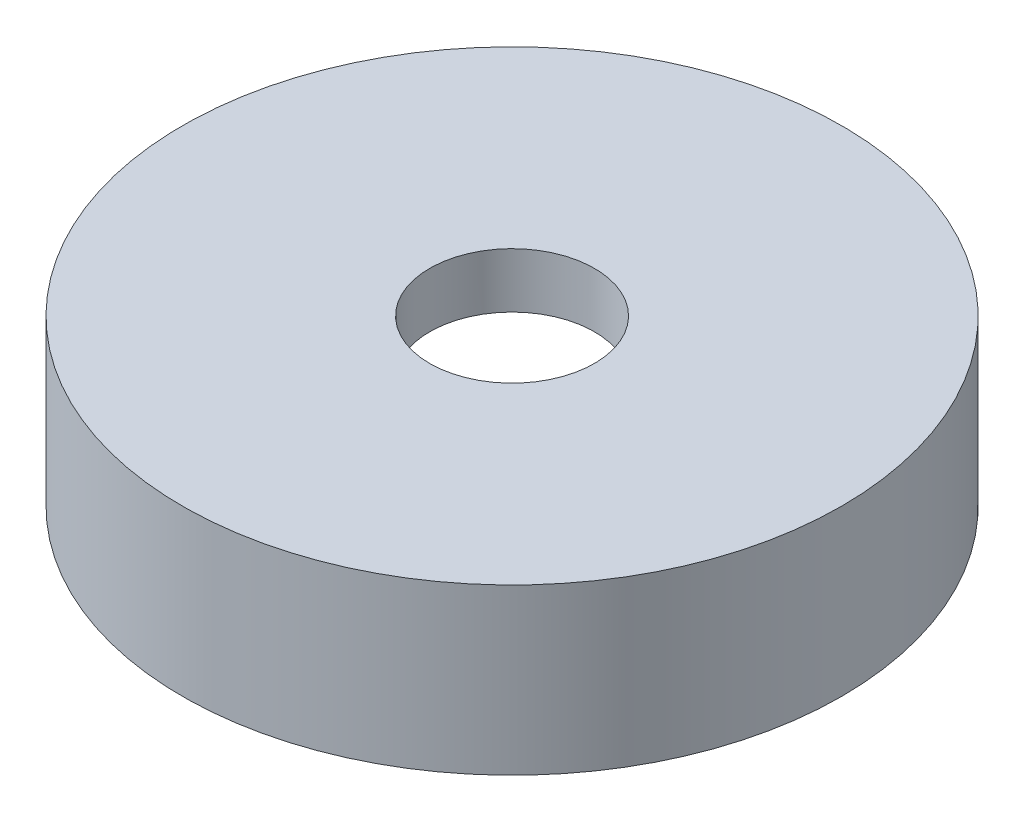
ISO-10303-21;
HEADER;
FILE_DESCRIPTION(('STEP AP214'),'2;1');
FILE_NAME('part.step','',(''),(''),'','','');
FILE_SCHEMA(('AUTOMOTIVE_DESIGN { 1 0 10303 214 1 1 1 1 }'));
ENDSEC;
DATA;
#1=APPLICATION_CONTEXT('core data for automotive mechanical design processes');
#2=APPLICATION_PROTOCOL_DEFINITION('international standard','automotive_design',2000,#1);
#3=PRODUCT_CONTEXT('',#1,'mechanical');
#4=PRODUCT('Part','Part','',(#3));
#5=PRODUCT_RELATED_PRODUCT_CATEGORY('part','',(#4));
#6=PRODUCT_DEFINITION_FORMATION('','',#4);
#7=PRODUCT_DEFINITION_CONTEXT('part definition',#1,'design');
#8=PRODUCT_DEFINITION('design','',#6,#7);
#9=PRODUCT_DEFINITION_SHAPE('','',#8);
#10=(LENGTH_UNIT() NAMED_UNIT(*) SI_UNIT(.MILLI.,.METRE.));
#11=(NAMED_UNIT(*) PLANE_ANGLE_UNIT() SI_UNIT($,.RADIAN.));
#12=(NAMED_UNIT(*) SI_UNIT($,.STERADIAN.) SOLID_ANGLE_UNIT());
#13=UNCERTAINTY_MEASURE_WITH_UNIT(LENGTH_MEASURE(1.E-05),#10,'distance_accuracy_value','');
#14=(GEOMETRIC_REPRESENTATION_CONTEXT(3) GLOBAL_UNCERTAINTY_ASSIGNED_CONTEXT((#13)) GLOBAL_UNIT_ASSIGNED_CONTEXT((#10,
#11,#12)) REPRESENTATION_CONTEXT('',''));
#15=CARTESIAN_POINT('',(0.,0.,0.));
#16=DIRECTION('',(0.,0.,1.));
#17=DIRECTION('',(1.,0.,0.));
#18=AXIS2_PLACEMENT_3D('',#15,#16,#17);
#19=CARTESIAN_POINT('',(0.,2.,0.));
#20=DIRECTION('',(0.,-1.,0.));
#21=DIRECTION('',(1.,0.,0.));
#22=AXIS2_PLACEMENT_3D('',#19,#20,#21);
#23=PLANE('',#22);
#24=CARTESIAN_POINT('',(0.,2.,0.));
#25=DIRECTION('',(0.,-1.,0.));
#26=DIRECTION('',(1.,0.,0.));
#27=AXIS2_PLACEMENT_3D('',#24,#25,#26);
#28=CIRCLE('',#27,1.5);
#29=CARTESIAN_POINT('',(1.5,2.,0.));
#30=VERTEX_POINT('',#29);
#31=EDGE_CURVE('E62',#30,#30,#28,.T.);
#32=ORIENTED_EDGE('',*,*,#31,.F.);
#33=EDGE_LOOP('',(#32));
#34=FACE_BOUND('',#33,.T.);
#35=CARTESIAN_POINT('',(0.,2.,0.));
#36=DIRECTION('',(0.,-1.,0.));
#37=DIRECTION('',(1.,0.,0.));
#38=AXIS2_PLACEMENT_3D('',#35,#36,#37);
#39=CIRCLE('',#38,5.);
#40=CARTESIAN_POINT('',(5.,2.,0.));
#41=VERTEX_POINT('',#40);
#42=EDGE_CURVE('E10',#41,#41,#39,.T.);
#43=ORIENTED_EDGE('',*,*,#42,.T.);
#44=EDGE_LOOP('',(#43));
#45=FACE_BOUND('',#44,.T.);
#46=ADVANCED_FACE('F39',(#34,#45),#23,.T.);
#47=CARTESIAN_POINT('',(0.,0.,0.));
#48=DIRECTION('',(0.,-1.,0.));
#49=DIRECTION('',(1.,0.,0.));
#50=AXIS2_PLACEMENT_3D('',#47,#48,#49);
#51=CYLINDRICAL_SURFACE('',#50,5.);
#52=CARTESIAN_POINT('',(0.,0.,0.));
#53=DIRECTION('',(0.,-1.,0.));
#54=DIRECTION('',(1.,0.,0.));
#55=AXIS2_PLACEMENT_3D('',#52,#53,#54);
#56=CIRCLE('',#55,5.);
#57=CARTESIAN_POINT('',(5.,0.,0.));
#58=VERTEX_POINT('',#57);
#59=EDGE_CURVE('E46',#58,#58,#56,.T.);
#60=ORIENTED_EDGE('',*,*,#59,.T.);
#61=EDGE_LOOP('',(#60));
#62=FACE_BOUND('',#61,.T.);
#63=ORIENTED_EDGE('',*,*,#42,.F.);
#64=EDGE_LOOP('',(#63));
#65=FACE_BOUND('',#64,.T.);
#66=ADVANCED_FACE('F88',(#62,#65),#51,.F.);
#67=CARTESIAN_POINT('',(5.,0.,0.));
#68=DIRECTION('',(0.,-1.,0.));
#69=DIRECTION('',(1.,0.,0.));
#70=AXIS2_PLACEMENT_3D('',#67,#68,#69);
#71=PLANE('',#70);
#72=CARTESIAN_POINT('',(0.,0.,0.));
#73=DIRECTION('',(0.,-1.,0.));
#74=DIRECTION('',(1.,0.,0.));
#75=AXIS2_PLACEMENT_3D('',#72,#73,#74);
#76=CIRCLE('',#75,6.);
#77=CARTESIAN_POINT('',(6.,0.,0.));
#78=VERTEX_POINT('',#77);
#79=EDGE_CURVE('E51',#78,#78,#76,.T.);
#80=ORIENTED_EDGE('',*,*,#79,.T.);
#81=EDGE_LOOP('',(#80));
#82=FACE_BOUND('',#81,.T.);
#83=ORIENTED_EDGE('',*,*,#59,.F.);
#84=EDGE_LOOP('',(#83));
#85=FACE_BOUND('',#84,.T.);
#86=ADVANCED_FACE('F82',(#82,#85),#71,.T.);
#87=CARTESIAN_POINT('',(0.,0.,0.));
#88=DIRECTION('',(0.,-1.,0.));
#89=DIRECTION('',(1.,0.,0.));
#90=AXIS2_PLACEMENT_3D('',#87,#88,#89);
#91=CYLINDRICAL_SURFACE('',#90,6.);
#92=CARTESIAN_POINT('',(0.,3.,0.));
#93=DIRECTION('',(0.,-1.,0.));
#94=DIRECTION('',(1.,0.,0.));
#95=AXIS2_PLACEMENT_3D('',#92,#93,#94);
#96=CIRCLE('',#95,6.);
#97=CARTESIAN_POINT('',(6.,3.,0.));
#98=VERTEX_POINT('',#97);
#99=EDGE_CURVE('E56',#98,#98,#96,.T.);
#100=ORIENTED_EDGE('',*,*,#99,.T.);
#101=EDGE_LOOP('',(#100));
#102=FACE_BOUND('',#101,.T.);
#103=ORIENTED_EDGE('',*,*,#79,.F.);
#104=EDGE_LOOP('',(#103));
#105=FACE_BOUND('',#104,.T.);
#106=ADVANCED_FACE('F76',(#102,#105),#91,.T.);
#107=CARTESIAN_POINT('',(0.,3.,0.));
#108=DIRECTION('',(0.,1.,0.));
#109=DIRECTION('',(-1.,0.,0.));
#110=AXIS2_PLACEMENT_3D('',#107,#108,#109);
#111=PLANE('',#110);
#112=CARTESIAN_POINT('',(0.,3.,0.));
#113=DIRECTION('',(0.,1.,0.));
#114=DIRECTION('',(0.,0.,1.));
#115=AXIS2_PLACEMENT_3D('',#112,#113,#114);
#116=CIRCLE('',#115,1.5);
#117=CARTESIAN_POINT('',(0.,3.,1.5));
#118=VERTEX_POINT('',#117);
#119=EDGE_CURVE('E66',#118,#118,#116,.T.);
#120=ORIENTED_EDGE('',*,*,#119,.F.);
#121=EDGE_LOOP('',(#120));
#122=FACE_BOUND('',#121,.T.);
#123=ORIENTED_EDGE('',*,*,#99,.F.);
#124=EDGE_LOOP('',(#123));
#125=FACE_BOUND('',#124,.T.);
#126=ADVANCED_FACE('F73',(#122,#125),#111,.T.);
#127=CARTESIAN_POINT('',(0.,3.,0.));
#128=DIRECTION('',(0.,1.,0.));
#129=DIRECTION('',(0.,0.,1.));
#130=AXIS2_PLACEMENT_3D('',#127,#128,#129);
#131=CYLINDRICAL_SURFACE('',#130,1.5);
#132=ORIENTED_EDGE('',*,*,#31,.T.);
#133=EDGE_LOOP('',(#132));
#134=FACE_BOUND('',#133,.T.);
#135=ORIENTED_EDGE('',*,*,#119,.T.);
#136=EDGE_LOOP('',(#135));
#137=FACE_BOUND('',#136,.T.);
#138=ADVANCED_FACE('F71',(#134,#137),#131,.F.);
#139=CLOSED_SHELL('',(#46,#66,#86,#106,#126,#138));
#140=MANIFOLD_SOLID_BREP('B2',#139);
#141=ADVANCED_BREP_SHAPE_REPRESENTATION('',(#18,#140),#14);
#142=SHAPE_DEFINITION_REPRESENTATION(#9,#141);
ENDSEC;
END-ISO-10303-21;
